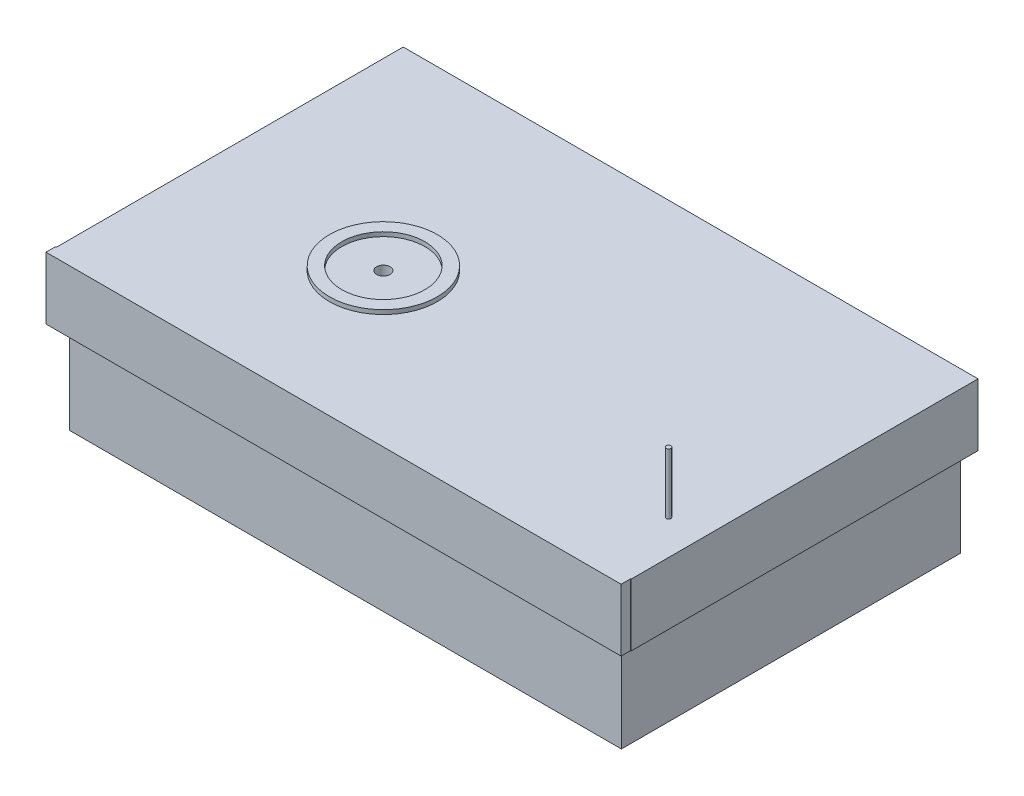
ISO-10303-21;
HEADER;
FILE_DESCRIPTION(('STEP AP214'),'2;1');
FILE_NAME('part.step','',(''),(''),'','','');
FILE_SCHEMA(('AUTOMOTIVE_DESIGN { 1 0 10303 214 1 1 1 1 }'));
ENDSEC;
DATA;
#1=APPLICATION_CONTEXT('core data for automotive mechanical design processes');
#2=APPLICATION_PROTOCOL_DEFINITION('international standard','automotive_design',2000,#1);
#3=PRODUCT_CONTEXT('',#1,'mechanical');
#4=PRODUCT('Part','Part','',(#3));
#5=PRODUCT_RELATED_PRODUCT_CATEGORY('part','',(#4));
#6=PRODUCT_DEFINITION_FORMATION('','',#4);
#7=PRODUCT_DEFINITION_CONTEXT('part definition',#1,'design');
#8=PRODUCT_DEFINITION('design','',#6,#7);
#9=PRODUCT_DEFINITION_SHAPE('','',#8);
#10=(LENGTH_UNIT() NAMED_UNIT(*) SI_UNIT(.MILLI.,.METRE.));
#11=(NAMED_UNIT(*) PLANE_ANGLE_UNIT() SI_UNIT($,.RADIAN.));
#12=(NAMED_UNIT(*) SI_UNIT($,.STERADIAN.) SOLID_ANGLE_UNIT());
#13=UNCERTAINTY_MEASURE_WITH_UNIT(LENGTH_MEASURE(1.E-05),#10,'distance_accuracy_value','');
#14=(GEOMETRIC_REPRESENTATION_CONTEXT(3) GLOBAL_UNCERTAINTY_ASSIGNED_CONTEXT((#13)) GLOBAL_UNIT_ASSIGNED_CONTEXT((#10,
#11,#12)) REPRESENTATION_CONTEXT('',''));
#15=CARTESIAN_POINT('',(0.,0.,0.));
#16=DIRECTION('',(0.,0.,1.));
#17=DIRECTION('',(1.,0.,0.));
#18=AXIS2_PLACEMENT_3D('',#15,#16,#17);
#19=CARTESIAN_POINT('',(-102.806921561605,30.,0.));
#20=DIRECTION('',(0.,0.,-1.));
#21=DIRECTION('',(-1.,0.,0.));
#22=AXIS2_PLACEMENT_3D('',#19,#20,#21);
#23=PLANE('',#22);
#24=DIRECTION('',(0.,1.,0.));
#25=VECTOR('',#24,1.);
#26=CARTESIAN_POINT('',(294.,44.0543155407096,0.));
#27=LINE('',#26,#25);
#28=CARTESIAN_POINT('',(294.,0.,0.));
#29=VERTEX_POINT('',#28);
#30=CARTESIAN_POINT('',(294.,44.0543155407096,0.));
#31=VERTEX_POINT('',#30);
#32=EDGE_CURVE('E149',#29,#31,#27,.T.);
#33=ORIENTED_EDGE('',*,*,#32,.F.);
#34=DIRECTION('',(1.,0.,0.));
#35=VECTOR('',#34,1.);
#36=CARTESIAN_POINT('',(294.407669047709,0.,0.));
#37=LINE('',#36,#35);
#38=CARTESIAN_POINT('',(294.407669047709,0.,0.));
#39=VERTEX_POINT('',#38);
#40=EDGE_CURVE('E221',#29,#39,#37,.T.);
#41=ORIENTED_EDGE('',*,*,#40,.T.);
#42=DIRECTION('',(0.,1.,0.));
#43=VECTOR('',#42,1.);
#44=CARTESIAN_POINT('',(294.407669047709,44.0543155407096,0.));
#45=LINE('',#44,#43);
#46=CARTESIAN_POINT('',(294.407669047709,44.0543155407096,0.));
#47=VERTEX_POINT('',#46);
#48=EDGE_CURVE('E229',#39,#47,#45,.T.);
#49=ORIENTED_EDGE('',*,*,#48,.T.);
#50=DIRECTION('',(-1.,0.,0.));
#51=VECTOR('',#50,1.);
#52=CARTESIAN_POINT('',(-112.352151293584,44.0543155407096,0.));
#53=LINE('',#52,#51);
#54=EDGE_CURVE('E52',#47,#31,#53,.T.);
#55=ORIENTED_EDGE('',*,*,#54,.T.);
#56=EDGE_LOOP('',(#33,#41,#49,#55));
#57=FACE_BOUND('',#56,.T.);
#58=ADVANCED_FACE('F38',(#57),#23,.F.);
#59=DIRECTION('',(1.,0.,0.));
#60=VECTOR('',#59,1.);
#61=CARTESIAN_POINT('',(-113.,0.,0.));
#62=LINE('',#61,#60);
#63=CARTESIAN_POINT('',(-102.861944811864,0.,0.));
#64=VERTEX_POINT('',#63);
#65=CARTESIAN_POINT('',(287.538362697054,0.,0.));
#66=VERTEX_POINT('',#65);
#67=EDGE_CURVE('E185',#64,#66,#62,.T.);
#68=ORIENTED_EDGE('',*,*,#67,.F.);
#69=DIRECTION('',(0.,1.,0.));
#70=VECTOR('',#69,1.);
#71=CARTESIAN_POINT('',(-102.861944811864,-63.5,0.));
#72=LINE('',#71,#70);
#73=CARTESIAN_POINT('',(-102.861944811864,-63.5,0.));
#74=VERTEX_POINT('',#73);
#75=EDGE_CURVE('E198',#74,#64,#72,.T.);
#76=ORIENTED_EDGE('',*,*,#75,.F.);
#77=DIRECTION('',(1.,0.,0.));
#78=VECTOR('',#77,1.);
#79=CARTESIAN_POINT('',(-102.861944811864,-63.5,0.));
#80=LINE('',#79,#78);
#81=CARTESIAN_POINT('',(287.538362697054,-63.5,0.));
#82=VERTEX_POINT('',#81);
#83=EDGE_CURVE('E267',#74,#82,#80,.T.);
#84=ORIENTED_EDGE('',*,*,#83,.T.);
#85=DIRECTION('',(0.,1.,0.));
#86=VECTOR('',#85,1.);
#87=CARTESIAN_POINT('',(287.538362697054,-63.5,0.));
#88=LINE('',#87,#86);
#89=EDGE_CURVE('E195',#82,#66,#88,.T.);
#90=ORIENTED_EDGE('',*,*,#89,.T.);
#91=EDGE_LOOP('',(#68,#76,#84,#90));
#92=FACE_BOUND('',#91,.T.);
#93=ADVANCED_FACE('F259',(#92),#23,.F.);
#94=CARTESIAN_POINT('',(-112.352151293584,44.0543155407096,-245.5));
#95=DIRECTION('',(0.,1.,0.));
#96=DIRECTION('',(0.,0.,1.));
#97=AXIS2_PLACEMENT_3D('',#94,#95,#96);
#98=PLANE('',#97);
#99=CARTESIAN_POINT('',(17.6478487064156,44.0543155407096,-101.450529821112));
#100=DIRECTION('',(0.,1.,0.));
#101=DIRECTION('',(0.,0.,1.));
#102=AXIS2_PLACEMENT_3D('',#99,#100,#101);
#103=CIRCLE('',#102,29.4156191603759);
#104=CARTESIAN_POINT('',(17.6478487064156,44.0543155407096,-72.0349106607356));
#105=VERTEX_POINT('',#104);
#106=EDGE_CURVE('E189',#105,#105,#103,.F.);
#107=ORIENTED_EDGE('',*,*,#106,.F.);
#108=EDGE_LOOP('',(#107));
#109=FACE_BOUND('',#108,.T.);
#110=CARTESIAN_POINT('',(17.6478487064156,44.0543155407097,-101.450529821112));
#111=DIRECTION('',(0.,1.,0.));
#112=DIRECTION('',(0.,0.,1.));
#113=AXIS2_PLACEMENT_3D('',#110,#111,#112);
#114=CIRCLE('',#113,4.7645);
#115=CARTESIAN_POINT('',(17.6478487064156,44.0543155407097,-96.6860298211115));
#116=VERTEX_POINT('',#115);
#117=EDGE_CURVE('E232',#116,#116,#114,.F.);
#118=ORIENTED_EDGE('',*,*,#117,.T.);
#119=EDGE_LOOP('',(#118));
#120=FACE_BOUND('',#119,.T.);
#121=ADVANCED_FACE('F287',(#109,#120),#98,.T.);
#122=CARTESIAN_POINT('',(269.705344771934,44.0543155407096,-51.2312767533685));
#123=DIRECTION('',(0.,1.,0.));
#124=DIRECTION('',(0.,0.,1.));
#125=AXIS2_PLACEMENT_3D('',#122,#123,#124);
#126=CIRCLE('',#125,1.65100000000002);
#127=CARTESIAN_POINT('',(269.705344771934,44.0543155407096,-49.5802767533685));
#128=VERTEX_POINT('',#127);
#129=EDGE_CURVE('E45',#128,#128,#126,.T.);
#130=ORIENTED_EDGE('',*,*,#129,.F.);
#131=EDGE_LOOP('',(#130));
#132=FACE_BOUND('',#131,.T.);
#133=ORIENTED_EDGE('',*,*,#54,.F.);
#134=DIRECTION('',(0.,0.,1.));
#135=VECTOR('',#134,1.);
#136=CARTESIAN_POINT('',(294.407669047709,44.0543155407096,-245.5));
#137=LINE('',#136,#135);
#138=CARTESIAN_POINT('',(294.407669047709,44.0543155407096,-245.5));
#139=VERTEX_POINT('',#138);
#140=EDGE_CURVE('E192',#139,#47,#137,.T.);
#141=ORIENTED_EDGE('',*,*,#140,.F.);
#142=DIRECTION('',(-1.,0.,0.));
#143=VECTOR('',#142,1.);
#144=CARTESIAN_POINT('',(-112.352151293584,44.0543155407096,-245.5));
#145=LINE('',#144,#143);
#146=CARTESIAN_POINT('',(-112.352151293584,44.0543155407096,-245.5));
#147=VERTEX_POINT('',#146);
#148=EDGE_CURVE('E296',#139,#147,#145,.T.);
#149=ORIENTED_EDGE('',*,*,#148,.T.);
#150=DIRECTION('',(0.,0.,1.));
#151=VECTOR('',#150,1.);
#152=CARTESIAN_POINT('',(-112.352151293584,44.0543155407096,-245.5));
#153=LINE('',#152,#151);
#154=CARTESIAN_POINT('',(-112.352151293584,44.0543155407096,0.));
#155=VERTEX_POINT('',#154);
#156=EDGE_CURVE('E214',#147,#155,#153,.T.);
#157=ORIENTED_EDGE('',*,*,#156,.T.);
#158=DIRECTION('',(1.,0.,0.));
#159=VECTOR('',#158,1.);
#160=CARTESIAN_POINT('',(-113.,44.0543155407096,0.));
#161=LINE('',#160,#159);
#162=CARTESIAN_POINT('',(-113.,44.0543155407096,0.));
#163=VERTEX_POINT('',#162);
#164=EDGE_CURVE('E141',#163,#155,#161,.T.);
#165=ORIENTED_EDGE('',*,*,#164,.F.);
#166=DIRECTION('',(0.,0.,1.));
#167=VECTOR('',#166,1.);
#168=CARTESIAN_POINT('',(-113.,44.0543155407096,0.));
#169=LINE('',#168,#167);
#170=CARTESIAN_POINT('',(-113.,44.0543155407096,6.65534344710744));
#171=VERTEX_POINT('',#170);
#172=EDGE_CURVE('E135',#163,#171,#169,.T.);
#173=ORIENTED_EDGE('',*,*,#172,.T.);
#174=DIRECTION('',(1.,0.,0.));
#175=VECTOR('',#174,1.);
#176=CARTESIAN_POINT('',(-113.,44.0543155407096,6.65534344710744));
#177=LINE('',#176,#175);
#178=CARTESIAN_POINT('',(294.,44.0543155407096,6.65534344710744));
#179=VERTEX_POINT('',#178);
#180=EDGE_CURVE('E128',#171,#179,#177,.T.);
#181=ORIENTED_EDGE('',*,*,#180,.T.);
#182=DIRECTION('',(0.,0.,1.));
#183=VECTOR('',#182,1.);
#184=CARTESIAN_POINT('',(294.,44.0543155407096,0.));
#185=LINE('',#184,#183);
#186=EDGE_CURVE('E132',#31,#179,#185,.T.);
#187=ORIENTED_EDGE('',*,*,#186,.F.);
#188=EDGE_LOOP('',(#133,#141,#149,#157,#165,#173,#181,#187));
#189=FACE_BOUND('',#188,.T.);
#190=CARTESIAN_POINT('',(17.6478487064156,44.0543155407096,-101.450529821112));
#191=DIRECTION('',(0.,1.,0.));
#192=DIRECTION('',(0.,0.,1.));
#193=AXIS2_PLACEMENT_3D('',#190,#191,#192);
#194=CIRCLE('',#193,38.1538633363303);
#195=CARTESIAN_POINT('',(17.6478487064156,44.0543155407096,-63.2966664847812));
#196=VERTEX_POINT('',#195);
#197=EDGE_CURVE('E235',#196,#196,#194,.T.);
#198=ORIENTED_EDGE('',*,*,#197,.F.);
#199=EDGE_LOOP('',(#198));
#200=FACE_BOUND('',#199,.T.);
#201=ADVANCED_FACE('F130',(#132,#189,#200),#98,.T.);
#202=CARTESIAN_POINT('',(-102.806921561605,30.,-240.));
#203=DIRECTION('',(0.,0.,1.));
#204=DIRECTION('',(1.,0.,0.));
#205=AXIS2_PLACEMENT_3D('',#202,#203,#204);
#206=PLANE('',#205);
#207=DIRECTION('',(0.,1.,0.));
#208=VECTOR('',#207,1.);
#209=CARTESIAN_POINT('',(-102.806921561605,-63.5,-240.));
#210=LINE('',#209,#208);
#211=CARTESIAN_POINT('',(-102.806921561605,-63.5,-240.));
#212=VERTEX_POINT('',#211);
#213=CARTESIAN_POINT('',(-102.806921561605,0.,-240.));
#214=VERTEX_POINT('',#213);
#215=EDGE_CURVE('E238',#212,#214,#210,.T.);
#216=ORIENTED_EDGE('',*,*,#215,.T.);
#217=DIRECTION('',(-1.,0.,0.));
#218=VECTOR('',#217,1.);
#219=CARTESIAN_POINT('',(-102.806921561605,0.,-240.));
#220=LINE('',#219,#218);
#221=CARTESIAN_POINT('',(287.538362697054,0.,-240.));
#222=VERTEX_POINT('',#221);
#223=EDGE_CURVE('E208',#222,#214,#220,.T.);
#224=ORIENTED_EDGE('',*,*,#223,.F.);
#225=DIRECTION('',(0.,1.,0.));
#226=VECTOR('',#225,1.);
#227=CARTESIAN_POINT('',(287.538362697054,-63.5,-240.));
#228=LINE('',#227,#226);
#229=CARTESIAN_POINT('',(287.538362697054,-63.5,-240.));
#230=VERTEX_POINT('',#229);
#231=EDGE_CURVE('E197',#230,#222,#228,.T.);
#232=ORIENTED_EDGE('',*,*,#231,.F.);
#233=DIRECTION('',(-1.,0.,0.));
#234=VECTOR('',#233,1.);
#235=CARTESIAN_POINT('',(-102.806921561605,-63.5,-240.));
#236=LINE('',#235,#234);
#237=EDGE_CURVE('E203',#230,#212,#236,.T.);
#238=ORIENTED_EDGE('',*,*,#237,.T.);
#239=EDGE_LOOP('',(#216,#224,#232,#238));
#240=FACE_BOUND('',#239,.T.);
#241=ADVANCED_FACE('F271',(#240),#206,.F.);
#242=CARTESIAN_POINT('',(-102.861944811864,-63.5,0.));
#243=DIRECTION('',(-0.999999973719115,0.,-0.000229263536722878));
#244=DIRECTION('',(-0.000229263536722878,0.,0.999999973719115));
#245=AXIS2_PLACEMENT_3D('',#242,#243,#244);
#246=PLANE('',#245);
#247=DIRECTION('',(-0.000229263536722878,0.,0.999999973719115));
#248=VECTOR('',#247,1.);
#249=CARTESIAN_POINT('',(-102.861944811864,0.,0.));
#250=LINE('',#249,#248);
#251=EDGE_CURVE('E191',#214,#64,#250,.T.);
#252=ORIENTED_EDGE('',*,*,#251,.F.);
#253=ORIENTED_EDGE('',*,*,#215,.F.);
#254=DIRECTION('',(-0.000229263536722878,0.,0.999999973719115));
#255=VECTOR('',#254,1.);
#256=CARTESIAN_POINT('',(-102.861944811864,-63.5,0.));
#257=LINE('',#256,#255);
#258=EDGE_CURVE('E241',#212,#74,#257,.T.);
#259=ORIENTED_EDGE('',*,*,#258,.T.);
#260=ORIENTED_EDGE('',*,*,#75,.T.);
#261=EDGE_LOOP('',(#252,#253,#259,#260));
#262=FACE_BOUND('',#261,.T.);
#263=ADVANCED_FACE('F264',(#262),#246,.T.);
#264=CARTESIAN_POINT('',(287.538362697054,-63.5,0.));
#265=DIRECTION('',(1.,0.,0.));
#266=DIRECTION('',(0.,0.,-1.));
#267=AXIS2_PLACEMENT_3D('',#264,#265,#266);
#268=PLANE('',#267);
#269=DIRECTION('',(0.,0.,-1.));
#270=VECTOR('',#269,1.);
#271=CARTESIAN_POINT('',(287.538362697054,0.,0.));
#272=LINE('',#271,#270);
#273=EDGE_CURVE('E60',#66,#222,#272,.T.);
#274=ORIENTED_EDGE('',*,*,#273,.F.);
#275=ORIENTED_EDGE('',*,*,#89,.F.);
#276=DIRECTION('',(0.,0.,-1.));
#277=VECTOR('',#276,1.);
#278=CARTESIAN_POINT('',(287.538362697054,-63.5,0.));
#279=LINE('',#278,#277);
#280=EDGE_CURVE('E253',#82,#230,#279,.T.);
#281=ORIENTED_EDGE('',*,*,#280,.T.);
#282=ORIENTED_EDGE('',*,*,#231,.T.);
#283=EDGE_LOOP('',(#274,#275,#281,#282));
#284=FACE_BOUND('',#283,.T.);
#285=ADVANCED_FACE('F251',(#284),#268,.T.);
#286=CARTESIAN_POINT('',(0.,-63.5,0.));
#287=DIRECTION('',(0.,-1.,0.));
#288=DIRECTION('',(0.,0.,-1.));
#289=AXIS2_PLACEMENT_3D('',#286,#287,#288);
#290=PLANE('',#289);
#291=ORIENTED_EDGE('',*,*,#258,.F.);
#292=ORIENTED_EDGE('',*,*,#237,.F.);
#293=ORIENTED_EDGE('',*,*,#280,.F.);
#294=ORIENTED_EDGE('',*,*,#83,.F.);
#295=EDGE_LOOP('',(#291,#292,#293,#294));
#296=FACE_BOUND('',#295,.T.);
#297=ADVANCED_FACE('F272',(#296),#290,.T.);
#298=CARTESIAN_POINT('',(294.407669047709,0.,-245.5));
#299=DIRECTION('',(0.,-1.,0.));
#300=DIRECTION('',(0.,0.,-1.));
#301=AXIS2_PLACEMENT_3D('',#298,#299,#300);
#302=PLANE('',#301);
#303=ORIENTED_EDGE('',*,*,#251,.T.);
#304=ORIENTED_EDGE('',*,*,#67,.T.);
#305=ORIENTED_EDGE('',*,*,#273,.T.);
#306=ORIENTED_EDGE('',*,*,#223,.T.);
#307=EDGE_LOOP('',(#303,#304,#305,#306));
#308=FACE_BOUND('',#307,.T.);
#309=CARTESIAN_POINT('',(-113.,0.,0.));
#310=VERTEX_POINT('',#309);
#311=CARTESIAN_POINT('',(-112.352151293584,0.,0.));
#312=VERTEX_POINT('',#311);
#313=EDGE_CURVE('E167',#310,#312,#62,.T.);
#314=ORIENTED_EDGE('',*,*,#313,.T.);
#315=DIRECTION('',(0.,0.,1.));
#316=VECTOR('',#315,1.);
#317=CARTESIAN_POINT('',(-112.352151293584,0.,-245.5));
#318=LINE('',#317,#316);
#319=CARTESIAN_POINT('',(-112.352151293584,0.,-245.5));
#320=VERTEX_POINT('',#319);
#321=EDGE_CURVE('E211',#320,#312,#318,.T.);
#322=ORIENTED_EDGE('',*,*,#321,.F.);
#323=DIRECTION('',(1.,0.,0.));
#324=VECTOR('',#323,1.);
#325=CARTESIAN_POINT('',(294.407669047709,0.,-245.5));
#326=LINE('',#325,#324);
#327=CARTESIAN_POINT('',(294.407669047709,0.,-245.5));
#328=VERTEX_POINT('',#327);
#329=EDGE_CURVE('E292',#320,#328,#326,.T.);
#330=ORIENTED_EDGE('',*,*,#329,.T.);
#331=DIRECTION('',(0.,0.,1.));
#332=VECTOR('',#331,1.);
#333=CARTESIAN_POINT('',(294.407669047709,0.,-245.5));
#334=LINE('',#333,#332);
#335=EDGE_CURVE('E213',#328,#39,#334,.T.);
#336=ORIENTED_EDGE('',*,*,#335,.T.);
#337=ORIENTED_EDGE('',*,*,#40,.F.);
#338=DIRECTION('',(0.,0.,-1.));
#339=VECTOR('',#338,1.);
#340=CARTESIAN_POINT('',(294.,0.,6.65534344710744));
#341=LINE('',#340,#339);
#342=CARTESIAN_POINT('',(294.,0.,6.65534344710744));
#343=VERTEX_POINT('',#342);
#344=EDGE_CURVE('E152',#343,#29,#341,.T.);
#345=ORIENTED_EDGE('',*,*,#344,.F.);
#346=DIRECTION('',(1.,0.,0.));
#347=VECTOR('',#346,1.);
#348=CARTESIAN_POINT('',(-113.,0.,6.65534344710744));
#349=LINE('',#348,#347);
#350=CARTESIAN_POINT('',(-113.,0.,6.65534344710744));
#351=VERTEX_POINT('',#350);
#352=EDGE_CURVE('E140',#351,#343,#349,.T.);
#353=ORIENTED_EDGE('',*,*,#352,.F.);
#354=DIRECTION('',(0.,0.,-1.));
#355=VECTOR('',#354,1.);
#356=CARTESIAN_POINT('',(-113.,0.,6.65534344710744));
#357=LINE('',#356,#355);
#358=EDGE_CURVE('E164',#351,#310,#357,.T.);
#359=ORIENTED_EDGE('',*,*,#358,.T.);
#360=EDGE_LOOP('',(#314,#322,#330,#336,#337,#345,#353,#359));
#361=FACE_BOUND('',#360,.T.);
#362=ADVANCED_FACE('F256',(#308,#361),#302,.T.);
#363=CARTESIAN_POINT('',(294.407669047709,44.0543155407096,-245.5));
#364=DIRECTION('',(1.,0.,0.));
#365=DIRECTION('',(0.,0.,-1.));
#366=AXIS2_PLACEMENT_3D('',#363,#364,#365);
#367=PLANE('',#366);
#368=ORIENTED_EDGE('',*,*,#48,.F.);
#369=ORIENTED_EDGE('',*,*,#335,.F.);
#370=DIRECTION('',(0.,1.,0.));
#371=VECTOR('',#370,1.);
#372=CARTESIAN_POINT('',(294.407669047709,44.0543155407096,-245.5));
#373=LINE('',#372,#371);
#374=EDGE_CURVE('E306',#328,#139,#373,.T.);
#375=ORIENTED_EDGE('',*,*,#374,.T.);
#376=ORIENTED_EDGE('',*,*,#140,.T.);
#377=EDGE_LOOP('',(#368,#369,#375,#376));
#378=FACE_BOUND('',#377,.T.);
#379=ADVANCED_FACE('F279',(#378),#367,.T.);
#380=CARTESIAN_POINT('',(-112.352151293584,0.,-245.5));
#381=DIRECTION('',(-1.,0.,0.));
#382=DIRECTION('',(0.,0.,1.));
#383=AXIS2_PLACEMENT_3D('',#380,#381,#382);
#384=PLANE('',#383);
#385=DIRECTION('',(0.,-1.,0.));
#386=VECTOR('',#385,1.);
#387=CARTESIAN_POINT('',(-112.352151293584,0.,0.));
#388=LINE('',#387,#386);
#389=EDGE_CURVE('E217',#155,#312,#388,.T.);
#390=ORIENTED_EDGE('',*,*,#389,.F.);
#391=ORIENTED_EDGE('',*,*,#156,.F.);
#392=DIRECTION('',(0.,-1.,0.));
#393=VECTOR('',#392,1.);
#394=CARTESIAN_POINT('',(-112.352151293584,0.,-245.5));
#395=LINE('',#394,#393);
#396=EDGE_CURVE('E298',#147,#320,#395,.T.);
#397=ORIENTED_EDGE('',*,*,#396,.T.);
#398=ORIENTED_EDGE('',*,*,#321,.T.);
#399=EDGE_LOOP('',(#390,#391,#397,#398));
#400=FACE_BOUND('',#399,.T.);
#401=ADVANCED_FACE('F310',(#400),#384,.T.);
#402=CARTESIAN_POINT('',(0.,0.,-245.5));
#403=DIRECTION('',(0.,0.,-1.));
#404=DIRECTION('',(-1.,0.,0.));
#405=AXIS2_PLACEMENT_3D('',#402,#403,#404);
#406=PLANE('',#405);
#407=ORIENTED_EDGE('',*,*,#148,.F.);
#408=ORIENTED_EDGE('',*,*,#374,.F.);
#409=ORIENTED_EDGE('',*,*,#329,.F.);
#410=ORIENTED_EDGE('',*,*,#396,.F.);
#411=EDGE_LOOP('',(#407,#408,#409,#410));
#412=FACE_BOUND('',#411,.T.);
#413=ADVANCED_FACE('F318',(#412),#406,.T.);
#414=CARTESIAN_POINT('',(17.6478487064156,47.0543155407097,-101.450529821112));
#415=DIRECTION('',(0.,-1.,0.));
#416=DIRECTION('',(0.,0.,-1.));
#417=AXIS2_PLACEMENT_3D('',#414,#415,#416);
#418=CYLINDRICAL_SURFACE('',#417,29.4156191603759);
#419=CARTESIAN_POINT('',(17.6478487064156,47.0543155407097,-101.450529821112));
#420=DIRECTION('',(0.,1.,0.));
#421=DIRECTION('',(0.,0.,1.));
#422=AXIS2_PLACEMENT_3D('',#419,#420,#421);
#423=CIRCLE('',#422,29.4156191603759);
#424=CARTESIAN_POINT('',(17.6478487064156,47.0543155407097,-72.0349106607356));
#425=VERTEX_POINT('',#424);
#426=EDGE_CURVE('E372',#425,#425,#423,.T.);
#427=ORIENTED_EDGE('',*,*,#426,.T.);
#428=EDGE_LOOP('',(#427));
#429=FACE_BOUND('',#428,.T.);
#430=ORIENTED_EDGE('',*,*,#106,.T.);
#431=EDGE_LOOP('',(#430));
#432=FACE_BOUND('',#431,.T.);
#433=ADVANCED_FACE('F320',(#429,#432),#418,.F.);
#434=CARTESIAN_POINT('',(17.6478487064156,47.0543155407097,-101.450529821112));
#435=DIRECTION('',(0.,-1.,0.));
#436=DIRECTION('',(0.,0.,-1.));
#437=AXIS2_PLACEMENT_3D('',#434,#435,#436);
#438=CYLINDRICAL_SURFACE('',#437,38.1538633363303);
#439=CARTESIAN_POINT('',(17.6478487064156,47.0543155407097,-101.450529821112));
#440=DIRECTION('',(0.,1.,0.));
#441=DIRECTION('',(0.,0.,1.));
#442=AXIS2_PLACEMENT_3D('',#439,#440,#441);
#443=CIRCLE('',#442,38.1538633363303);
#444=CARTESIAN_POINT('',(17.6478487064156,47.0543155407097,-63.2966664847812));
#445=VERTEX_POINT('',#444);
#446=EDGE_CURVE('E369',#445,#445,#443,.T.);
#447=ORIENTED_EDGE('',*,*,#446,.F.);
#448=EDGE_LOOP('',(#447));
#449=FACE_BOUND('',#448,.T.);
#450=ORIENTED_EDGE('',*,*,#197,.T.);
#451=EDGE_LOOP('',(#450));
#452=FACE_BOUND('',#451,.T.);
#453=ADVANCED_FACE('F326',(#449,#452),#438,.T.);
#454=CARTESIAN_POINT('',(0.,47.0543155407097,0.));
#455=DIRECTION('',(0.,1.,0.));
#456=DIRECTION('',(0.,0.,1.));
#457=AXIS2_PLACEMENT_3D('',#454,#455,#456);
#458=PLANE('',#457);
#459=ORIENTED_EDGE('',*,*,#426,.F.);
#460=EDGE_LOOP('',(#459));
#461=FACE_BOUND('',#460,.T.);
#462=ORIENTED_EDGE('',*,*,#446,.T.);
#463=EDGE_LOOP('',(#462));
#464=FACE_BOUND('',#463,.T.);
#465=ADVANCED_FACE('F347',(#461,#464),#458,.T.);
#466=CARTESIAN_POINT('',(17.6478487064156,142.,-101.450529821112));
#467=DIRECTION('',(0.,-1.,0.));
#468=DIRECTION('',(0.,0.,-1.));
#469=AXIS2_PLACEMENT_3D('',#466,#467,#468);
#470=CYLINDRICAL_SURFACE('',#469,4.7645);
#471=ORIENTED_EDGE('',*,*,#117,.F.);
#472=EDGE_LOOP('',(#471));
#473=FACE_BOUND('',#472,.T.);
#474=CARTESIAN_POINT('',(17.6478487064156,0.,-101.450529821112));
#475=DIRECTION('',(0.,1.,0.));
#476=DIRECTION('',(0.,0.,1.));
#477=AXIS2_PLACEMENT_3D('',#474,#475,#476);
#478=CIRCLE('',#477,4.7645);
#479=CARTESIAN_POINT('',(17.6478487064156,0.,-96.6860298211115));
#480=VERTEX_POINT('',#479);
#481=EDGE_CURVE('E176',#480,#480,#478,.T.);
#482=ORIENTED_EDGE('',*,*,#481,.F.);
#483=EDGE_LOOP('',(#482));
#484=FACE_BOUND('',#483,.T.);
#485=ADVANCED_FACE('F343',(#473,#484),#470,.F.);
#486=CARTESIAN_POINT('',(17.6478487064156,0.,-101.450529821112));
#487=DIRECTION('',(0.,1.,0.));
#488=DIRECTION('',(0.,0.,1.));
#489=AXIS2_PLACEMENT_3D('',#486,#487,#488);
#490=PLANE('',#489);
#491=ORIENTED_EDGE('',*,*,#481,.T.);
#492=EDGE_LOOP('',(#491));
#493=FACE_BOUND('',#492,.T.);
#494=ADVANCED_FACE('F346',(#493),#490,.T.);
#495=CARTESIAN_POINT('',(-113.,44.0543155407096,0.));
#496=DIRECTION('',(0.,0.,-1.));
#497=DIRECTION('',(-1.,0.,0.));
#498=AXIS2_PLACEMENT_3D('',#495,#496,#497);
#499=PLANE('',#498);
#500=ORIENTED_EDGE('',*,*,#164,.T.);
#501=ORIENTED_EDGE('',*,*,#389,.T.);
#502=ORIENTED_EDGE('',*,*,#313,.F.);
#503=DIRECTION('',(0.,1.,0.));
#504=VECTOR('',#503,1.);
#505=CARTESIAN_POINT('',(-113.,44.0543155407096,0.));
#506=LINE('',#505,#504);
#507=EDGE_CURVE('E154',#310,#163,#506,.T.);
#508=ORIENTED_EDGE('',*,*,#507,.T.);
#509=EDGE_LOOP('',(#500,#501,#502,#508));
#510=FACE_BOUND('',#509,.T.);
#511=ADVANCED_FACE('F312',(#510),#499,.T.);
#512=CARTESIAN_POINT('',(-113.,44.0543155407096,6.65534344710744));
#513=DIRECTION('',(0.,0.,1.));
#514=DIRECTION('',(1.,0.,0.));
#515=AXIS2_PLACEMENT_3D('',#512,#513,#514);
#516=PLANE('',#515);
#517=ORIENTED_EDGE('',*,*,#352,.T.);
#518=DIRECTION('',(0.,-1.,0.));
#519=VECTOR('',#518,1.);
#520=CARTESIAN_POINT('',(294.,44.0543155407096,6.65534344710744));
#521=LINE('',#520,#519);
#522=EDGE_CURVE('E147',#179,#343,#521,.T.);
#523=ORIENTED_EDGE('',*,*,#522,.F.);
#524=ORIENTED_EDGE('',*,*,#180,.F.);
#525=DIRECTION('',(0.,-1.,0.));
#526=VECTOR('',#525,1.);
#527=CARTESIAN_POINT('',(-113.,44.0543155407096,6.65534344710744));
#528=LINE('',#527,#526);
#529=EDGE_CURVE('E162',#171,#351,#528,.T.);
#530=ORIENTED_EDGE('',*,*,#529,.T.);
#531=EDGE_LOOP('',(#517,#523,#524,#530));
#532=FACE_BOUND('',#531,.T.);
#533=ADVANCED_FACE('F151',(#532),#516,.T.);
#534=CARTESIAN_POINT('',(-113.,0.,0.));
#535=DIRECTION('',(1.,0.,0.));
#536=DIRECTION('',(0.,0.,-1.));
#537=AXIS2_PLACEMENT_3D('',#534,#535,#536);
#538=PLANE('',#537);
#539=ORIENTED_EDGE('',*,*,#507,.F.);
#540=ORIENTED_EDGE('',*,*,#358,.F.);
#541=ORIENTED_EDGE('',*,*,#529,.F.);
#542=ORIENTED_EDGE('',*,*,#172,.F.);
#543=EDGE_LOOP('',(#539,#540,#541,#542));
#544=FACE_BOUND('',#543,.T.);
#545=ADVANCED_FACE('F316',(#544),#538,.F.);
#546=CARTESIAN_POINT('',(294.,0.,0.));
#547=DIRECTION('',(1.,0.,0.));
#548=DIRECTION('',(0.,0.,-1.));
#549=AXIS2_PLACEMENT_3D('',#546,#547,#548);
#550=PLANE('',#549);
#551=ORIENTED_EDGE('',*,*,#32,.T.);
#552=ORIENTED_EDGE('',*,*,#186,.T.);
#553=ORIENTED_EDGE('',*,*,#522,.T.);
#554=ORIENTED_EDGE('',*,*,#344,.T.);
#555=EDGE_LOOP('',(#551,#552,#553,#554));
#556=FACE_BOUND('',#555,.T.);
#557=ADVANCED_FACE('F145',(#556),#550,.T.);
#558=CARTESIAN_POINT('',(269.705344771934,-2.,-51.2312767533685));
#559=DIRECTION('',(0.,1.,0.));
#560=DIRECTION('',(0.,0.,1.));
#561=AXIS2_PLACEMENT_3D('',#558,#559,#560);
#562=CYLINDRICAL_SURFACE('',#561,1.65100000000002);
#563=CARTESIAN_POINT('',(269.705344771934,87.0111035868716,-51.2312767533685));
#564=DIRECTION('',(0.,-1.,0.));
#565=DIRECTION('',(0.,0.,-1.));
#566=AXIS2_PLACEMENT_3D('',#563,#564,#565);
#567=CIRCLE('',#566,1.65100000000002);
#568=CARTESIAN_POINT('',(269.705344771934,87.0111035868716,-52.8822767533685));
#569=VERTEX_POINT('',#568);
#570=EDGE_CURVE('E11',#569,#569,#567,.F.);
#571=ORIENTED_EDGE('',*,*,#570,.F.);
#572=EDGE_LOOP('',(#571));
#573=FACE_BOUND('',#572,.T.);
#574=ORIENTED_EDGE('',*,*,#129,.T.);
#575=EDGE_LOOP('',(#574));
#576=FACE_BOUND('',#575,.T.);
#577=ADVANCED_FACE('F478',(#573,#576),#562,.T.);
#578=CARTESIAN_POINT('',(271.356344771934,87.0111035868716,-112.));
#579=DIRECTION('',(0.,-1.,0.));
#580=DIRECTION('',(0.,0.,-1.));
#581=AXIS2_PLACEMENT_3D('',#578,#579,#580);
#582=PLANE('',#581);
#583=ORIENTED_EDGE('',*,*,#570,.T.);
#584=EDGE_LOOP('',(#583));
#585=FACE_BOUND('',#584,.T.);
#586=ADVANCED_FACE('F493',(#585),#582,.F.);
#587=CLOSED_SHELL('',(#58,#93,#121,#201,#241,#263,#285,#297,#362,#379,#401,#413,#433,#453,#465,
#485,#494,#511,#533,#545,#557,#577,#586));
#588=MANIFOLD_SOLID_BREP('B2',#587);
#589=ADVANCED_BREP_SHAPE_REPRESENTATION('',(#18,#588),#14);
#590=SHAPE_DEFINITION_REPRESENTATION(#9,#589);
ENDSEC;
END-ISO-10303-21;
